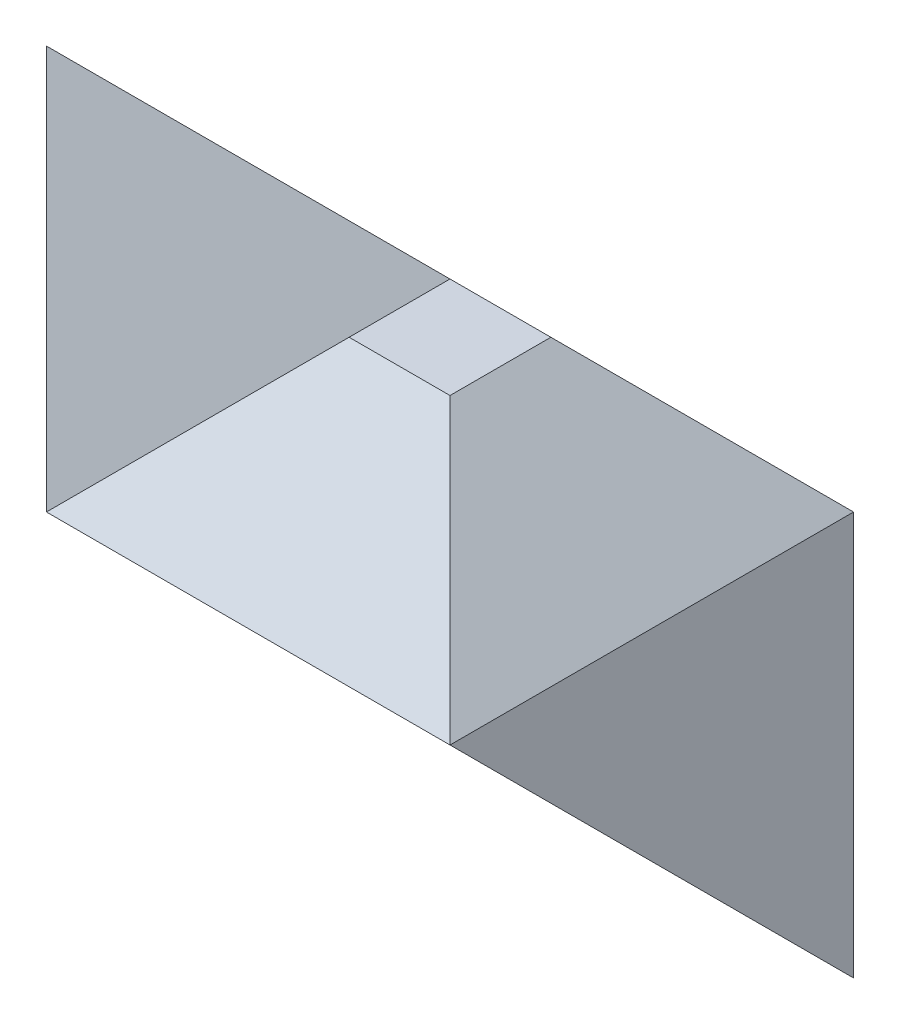
ISO-10303-21;
HEADER;
FILE_DESCRIPTION(('STEP AP214'),'2;1');
FILE_NAME('part.step','',(''),(''),'','','');
FILE_SCHEMA(('AUTOMOTIVE_DESIGN { 1 0 10303 214 1 1 1 1 }'));
ENDSEC;
DATA;
#1=APPLICATION_CONTEXT('core data for automotive mechanical design processes');
#2=APPLICATION_PROTOCOL_DEFINITION('international standard','automotive_design',2000,#1);
#3=PRODUCT_CONTEXT('',#1,'mechanical');
#4=PRODUCT('Part','Part','',(#3));
#5=PRODUCT_RELATED_PRODUCT_CATEGORY('part','',(#4));
#6=PRODUCT_DEFINITION_FORMATION('','',#4);
#7=PRODUCT_DEFINITION_CONTEXT('part definition',#1,'design');
#8=PRODUCT_DEFINITION('design','',#6,#7);
#9=PRODUCT_DEFINITION_SHAPE('','',#8);
#10=(LENGTH_UNIT() NAMED_UNIT(*) SI_UNIT(.MILLI.,.METRE.));
#11=(NAMED_UNIT(*) PLANE_ANGLE_UNIT() SI_UNIT($,.RADIAN.));
#12=(NAMED_UNIT(*) SI_UNIT($,.STERADIAN.) SOLID_ANGLE_UNIT());
#13=UNCERTAINTY_MEASURE_WITH_UNIT(LENGTH_MEASURE(1.E-05),#10,'distance_accuracy_value','');
#14=(GEOMETRIC_REPRESENTATION_CONTEXT(3) GLOBAL_UNCERTAINTY_ASSIGNED_CONTEXT((#13)) GLOBAL_UNIT_ASSIGNED_CONTEXT((#10,
#11,#12)) REPRESENTATION_CONTEXT('',''));
#15=CARTESIAN_POINT('',(0.,0.,0.));
#16=DIRECTION('',(0.,0.,1.));
#17=DIRECTION('',(1.,0.,0.));
#18=AXIS2_PLACEMENT_3D('',#15,#16,#17);
#19=CARTESIAN_POINT('',(0.,0.,0.));
#20=DIRECTION('',(0.707106781186549,0.,-0.707106781186546));
#21=DIRECTION('',(-0.707106781186546,0.,-0.707106781186549));
#22=AXIS2_PLACEMENT_3D('',#19,#20,#21);
#23=PLANE('',#22);
#24=DIRECTION('',(-0.577350269189626,0.577350269189624,-0.577350269189628));
#25=VECTOR('',#24,1.);
#26=CARTESIAN_POINT('',(0.,0.,0.));
#27=LINE('',#26,#25);
#28=CARTESIAN_POINT('',(0.,0.,0.));
#29=VERTEX_POINT('',#28);
#30=CARTESIAN_POINT('',(-12.7,12.7,-12.7000000000001));
#31=VERTEX_POINT('',#30);
#32=EDGE_CURVE('E175',#29,#31,#27,.T.);
#33=ORIENTED_EDGE('',*,*,#32,.T.);
#34=DIRECTION('',(0.,1.,0.));
#35=VECTOR('',#34,1.);
#36=CARTESIAN_POINT('',(-12.7,0.,-12.7000000000001));
#37=LINE('',#36,#35);
#38=CARTESIAN_POINT('',(-12.7,-12.7,-12.7000000000001));
#39=VERTEX_POINT('',#38);
#40=EDGE_CURVE('E97',#39,#31,#37,.T.);
#41=ORIENTED_EDGE('',*,*,#40,.F.);
#42=DIRECTION('',(-0.577350269189626,-0.577350269189624,-0.577350269189628));
#43=VECTOR('',#42,1.);
#44=CARTESIAN_POINT('',(0.,0.,0.));
#45=LINE('',#44,#43);
#46=EDGE_CURVE('E179',#29,#39,#45,.T.);
#47=ORIENTED_EDGE('',*,*,#46,.F.);
#48=EDGE_LOOP('',(#33,#41,#47));
#49=FACE_BOUND('',#48,.T.);
#50=ADVANCED_FACE('F88',(#49),#23,.F.);
#51=CARTESIAN_POINT('',(-12.7,0.,-12.7000000000001));
#52=DIRECTION('',(0.707106781186544,0.,0.707106781186551));
#53=DIRECTION('',(0.707106781186551,0.,-0.707106781186544));
#54=AXIS2_PLACEMENT_3D('',#51,#52,#53);
#55=PLANE('',#54);
#56=ORIENTED_EDGE('',*,*,#40,.T.);
#57=DIRECTION('',(-0.577350269189629,0.577350269189627,0.577350269189622));
#58=VECTOR('',#57,1.);
#59=CARTESIAN_POINT('',(0.,0.,-25.4));
#60=LINE('',#59,#58);
#61=CARTESIAN_POINT('',(0.,0.,-25.4));
#62=VERTEX_POINT('',#61);
#63=EDGE_CURVE('E12',#62,#31,#60,.T.);
#64=ORIENTED_EDGE('',*,*,#63,.F.);
#65=DIRECTION('',(-0.577350269189629,-0.577350269189627,0.577350269189622));
#66=VECTOR('',#65,1.);
#67=CARTESIAN_POINT('',(0.,0.,-25.4));
#68=LINE('',#67,#66);
#69=EDGE_CURVE('E109',#62,#39,#68,.T.);
#70=ORIENTED_EDGE('',*,*,#69,.T.);
#71=EDGE_LOOP('',(#56,#64,#70));
#72=FACE_BOUND('',#71,.T.);
#73=ADVANCED_FACE('F344',(#72),#55,.F.);
#74=CARTESIAN_POINT('',(0.,0.,0.));
#75=DIRECTION('',(-0.707106781186546,-0.707106781186549,0.));
#76=DIRECTION('',(0.707106781186549,-0.707106781186546,0.));
#77=AXIS2_PLACEMENT_3D('',#74,#75,#76);
#78=PLANE('',#77);
#79=ORIENTED_EDGE('',*,*,#63,.T.);
#80=ORIENTED_EDGE('',*,*,#32,.F.);
#81=DIRECTION('',(0.,0.,-1.));
#82=VECTOR('',#81,1.);
#83=CARTESIAN_POINT('',(0.,0.,0.));
#84=LINE('',#83,#82);
#85=EDGE_CURVE('E168',#29,#62,#84,.T.);
#86=ORIENTED_EDGE('',*,*,#85,.T.);
#87=EDGE_LOOP('',(#79,#80,#86));
#88=FACE_BOUND('',#87,.T.);
#89=ADVANCED_FACE('F90',(#88),#78,.F.);
#90=CARTESIAN_POINT('',(0.,0.,0.));
#91=DIRECTION('',(0.,-0.70710678118655,0.707106781186545));
#92=DIRECTION('',(-0.577350269189626,-0.577350269189624,-0.577350269189628));
#93=AXIS2_PLACEMENT_3D('',#90,#91,#92);
#94=PLANE('',#93);
#95=ORIENTED_EDGE('',*,*,#46,.T.);
#96=DIRECTION('',(1.,0.,0.));
#97=VECTOR('',#96,1.);
#98=CARTESIAN_POINT('',(12.7,-12.7,-12.7000000000001));
#99=LINE('',#98,#97);
#100=CARTESIAN_POINT('',(38.1000000000001,-12.7,-12.7000000000001));
#101=VERTEX_POINT('',#100);
#102=EDGE_CURVE('E183',#39,#101,#99,.T.);
#103=ORIENTED_EDGE('',*,*,#102,.T.);
#104=DIRECTION('',(0.577350269189626,-0.577350269189624,-0.577350269189628));
#105=VECTOR('',#104,1.);
#106=CARTESIAN_POINT('',(31.75,-6.35,-6.35000000000004));
#107=LINE('',#106,#105);
#108=CARTESIAN_POINT('',(25.4,0.,0.));
#109=VERTEX_POINT('',#108);
#110=EDGE_CURVE('E188',#109,#101,#107,.T.);
#111=ORIENTED_EDGE('',*,*,#110,.F.);
#112=DIRECTION('',(1.,0.,0.));
#113=VECTOR('',#112,1.);
#114=CARTESIAN_POINT('',(12.7,0.,0.));
#115=LINE('',#114,#113);
#116=EDGE_CURVE('E157',#29,#109,#115,.T.);
#117=ORIENTED_EDGE('',*,*,#116,.F.);
#118=EDGE_LOOP('',(#95,#103,#111,#117));
#119=FACE_BOUND('',#118,.T.);
#120=ADVANCED_FACE('F186',(#119),#94,.T.);
#121=CARTESIAN_POINT('',(-12.7,-12.7,-12.7000000000001));
#122=DIRECTION('',(0.,-0.707106781186545,-0.70710678118655));
#123=DIRECTION('',(0.577350269189629,0.577350269189627,-0.577350269189622));
#124=AXIS2_PLACEMENT_3D('',#121,#122,#123);
#125=PLANE('',#124);
#126=ORIENTED_EDGE('',*,*,#69,.F.);
#127=DIRECTION('',(1.,0.,0.));
#128=VECTOR('',#127,1.);
#129=CARTESIAN_POINT('',(12.7,0.,-25.4));
#130=LINE('',#129,#128);
#131=CARTESIAN_POINT('',(25.4,0.,-25.4));
#132=VERTEX_POINT('',#131);
#133=EDGE_CURVE('E189',#62,#132,#130,.T.);
#134=ORIENTED_EDGE('',*,*,#133,.T.);
#135=DIRECTION('',(-0.577350269189629,0.577350269189626,-0.577350269189622));
#136=VECTOR('',#135,1.);
#137=CARTESIAN_POINT('',(31.75,-6.35,-19.05));
#138=LINE('',#137,#136);
#139=EDGE_CURVE('E192',#101,#132,#138,.T.);
#140=ORIENTED_EDGE('',*,*,#139,.F.);
#141=ORIENTED_EDGE('',*,*,#102,.F.);
#142=EDGE_LOOP('',(#126,#134,#140,#141));
#143=FACE_BOUND('',#142,.T.);
#144=ADVANCED_FACE('F350',(#143),#125,.T.);
#145=CARTESIAN_POINT('',(12.7,0.,12.7));
#146=DIRECTION('',(0.707106781186549,0.,0.707106781186546));
#147=DIRECTION('',(0.707106781186546,0.,-0.707106781186549));
#148=AXIS2_PLACEMENT_3D('',#145,#146,#147);
#149=PLANE('',#148);
#150=DIRECTION('',(0.,1.,0.));
#151=VECTOR('',#150,1.);
#152=CARTESIAN_POINT('',(38.1000000000001,0.,-12.7000000000001));
#153=LINE('',#152,#151);
#154=CARTESIAN_POINT('',(38.1000000000001,12.7,-12.7000000000001));
#155=VERTEX_POINT('',#154);
#156=EDGE_CURVE('E230',#101,#155,#153,.T.);
#157=ORIENTED_EDGE('',*,*,#156,.T.);
#158=DIRECTION('',(0.577350269189626,0.577350269189624,-0.577350269189628));
#159=VECTOR('',#158,1.);
#160=CARTESIAN_POINT('',(25.4,0.,0.));
#161=LINE('',#160,#159);
#162=EDGE_CURVE('E129',#109,#155,#161,.T.);
#163=ORIENTED_EDGE('',*,*,#162,.F.);
#164=ORIENTED_EDGE('',*,*,#110,.T.);
#165=EDGE_LOOP('',(#157,#163,#164));
#166=FACE_BOUND('',#165,.T.);
#167=ADVANCED_FACE('F255',(#166),#149,.T.);
#168=CARTESIAN_POINT('',(12.6999999999999,-12.7,0.));
#169=DIRECTION('',(0.707106781186546,-0.707106781186549,0.));
#170=DIRECTION('',(0.707106781186549,0.707106781186546,0.));
#171=AXIS2_PLACEMENT_3D('',#168,#169,#170);
#172=PLANE('',#171);
#173=ORIENTED_EDGE('',*,*,#162,.T.);
#174=DIRECTION('',(0.577350269189629,0.577350269189626,0.577350269189622));
#175=VECTOR('',#174,1.);
#176=CARTESIAN_POINT('',(25.4,0.,-25.4));
#177=LINE('',#176,#175);
#178=EDGE_CURVE('E203',#132,#155,#177,.T.);
#179=ORIENTED_EDGE('',*,*,#178,.F.);
#180=DIRECTION('',(0.,0.,1.));
#181=VECTOR('',#180,1.);
#182=CARTESIAN_POINT('',(25.4,0.,-12.7));
#183=LINE('',#182,#181);
#184=EDGE_CURVE('E201',#132,#109,#183,.T.);
#185=ORIENTED_EDGE('',*,*,#184,.T.);
#186=EDGE_LOOP('',(#173,#179,#185));
#187=FACE_BOUND('',#186,.T.);
#188=ADVANCED_FACE('F357',(#187),#172,.F.);
#189=CARTESIAN_POINT('',(25.3999999999999,0.,-25.4000000000001));
#190=DIRECTION('',(-0.707106781186544,0.,0.707106781186551));
#191=DIRECTION('',(0.707106781186551,0.,0.707106781186544));
#192=AXIS2_PLACEMENT_3D('',#189,#190,#191);
#193=PLANE('',#192);
#194=ORIENTED_EDGE('',*,*,#178,.T.);
#195=ORIENTED_EDGE('',*,*,#156,.F.);
#196=ORIENTED_EDGE('',*,*,#139,.T.);
#197=EDGE_LOOP('',(#194,#195,#196));
#198=FACE_BOUND('',#197,.T.);
#199=ADVANCED_FACE('F251',(#198),#193,.F.);
#200=CARTESIAN_POINT('',(0.,9.525,0.));
#201=DIRECTION('',(0.,1.,0.));
#202=DIRECTION('',(0.,0.,1.));
#203=AXIS2_PLACEMENT_3D('',#200,#201,#202);
#204=PLANE('',#203);
#205=DIRECTION('',(0.,0.,1.));
#206=VECTOR('',#205,1.);
#207=CARTESIAN_POINT('',(9.525,9.525,-15.875));
#208=LINE('',#207,#206);
#209=CARTESIAN_POINT('',(9.525,9.525,-15.875));
#210=VERTEX_POINT('',#209);
#211=CARTESIAN_POINT('',(9.525,9.525,-9.525));
#212=VERTEX_POINT('',#211);
#213=EDGE_CURVE('E281',#210,#212,#208,.T.);
#214=ORIENTED_EDGE('',*,*,#213,.T.);
#215=DIRECTION('',(1.,0.,0.));
#216=VECTOR('',#215,1.);
#217=CARTESIAN_POINT('',(9.525,9.525,-9.525));
#218=LINE('',#217,#216);
#219=CARTESIAN_POINT('',(15.875,9.525,-9.525));
#220=VERTEX_POINT('',#219);
#221=EDGE_CURVE('E160',#212,#220,#218,.T.);
#222=ORIENTED_EDGE('',*,*,#221,.T.);
#223=DIRECTION('',(0.,0.,-1.));
#224=VECTOR('',#223,1.);
#225=CARTESIAN_POINT('',(15.875,9.525,-15.875));
#226=LINE('',#225,#224);
#227=CARTESIAN_POINT('',(15.875,9.525,-15.875));
#228=VERTEX_POINT('',#227);
#229=EDGE_CURVE('E280',#220,#228,#226,.T.);
#230=ORIENTED_EDGE('',*,*,#229,.T.);
#231=DIRECTION('',(-1.,0.,0.));
#232=VECTOR('',#231,1.);
#233=CARTESIAN_POINT('',(9.525,9.525,-15.875));
#234=LINE('',#233,#232);
#235=EDGE_CURVE('E234',#228,#210,#234,.T.);
#236=ORIENTED_EDGE('',*,*,#235,.T.);
#237=EDGE_LOOP('',(#214,#222,#230,#236));
#238=FACE_BOUND('',#237,.T.);
#239=ADVANCED_FACE('F240',(#238),#204,.T.);
#240=CARTESIAN_POINT('',(0.,12.7,-12.7));
#241=DIRECTION('',(0.,-0.707106781186547,0.707106781186548));
#242=DIRECTION('',(0.,-0.707106781186548,-0.707106781186547));
#243=AXIS2_PLACEMENT_3D('',#240,#241,#242);
#244=PLANE('',#243);
#245=DIRECTION('',(0.577350269189626,0.577350269189626,0.577350269189625));
#246=VECTOR('',#245,1.);
#247=CARTESIAN_POINT('',(0.,0.,-25.4));
#248=LINE('',#247,#246);
#249=EDGE_CURVE('E172',#62,#210,#248,.T.);
#250=ORIENTED_EDGE('',*,*,#249,.T.);
#251=ORIENTED_EDGE('',*,*,#235,.F.);
#252=DIRECTION('',(-0.577350269189626,0.577350269189626,0.577350269189626));
#253=VECTOR('',#252,1.);
#254=CARTESIAN_POINT('',(25.4,0.,-25.4));
#255=LINE('',#254,#253);
#256=EDGE_CURVE('E134',#132,#228,#255,.T.);
#257=ORIENTED_EDGE('',*,*,#256,.F.);
#258=ORIENTED_EDGE('',*,*,#133,.F.);
#259=EDGE_LOOP('',(#250,#251,#257,#258));
#260=FACE_BOUND('',#259,.T.);
#261=ADVANCED_FACE('F250',(#260),#244,.F.);
#262=CARTESIAN_POINT('',(12.7,12.7,0.));
#263=DIRECTION('',(-0.707106781186548,-0.707106781186547,0.));
#264=DIRECTION('',(0.707106781186547,-0.707106781186548,0.));
#265=AXIS2_PLACEMENT_3D('',#262,#263,#264);
#266=PLANE('',#265);
#267=ORIENTED_EDGE('',*,*,#256,.T.);
#268=ORIENTED_EDGE('',*,*,#229,.F.);
#269=DIRECTION('',(-0.577350269189626,0.577350269189626,-0.577350269189626));
#270=VECTOR('',#269,1.);
#271=CARTESIAN_POINT('',(25.4,0.,0.));
#272=LINE('',#271,#270);
#273=EDGE_CURVE('E121',#109,#220,#272,.T.);
#274=ORIENTED_EDGE('',*,*,#273,.F.);
#275=ORIENTED_EDGE('',*,*,#184,.F.);
#276=EDGE_LOOP('',(#267,#268,#274,#275));
#277=FACE_BOUND('',#276,.T.);
#278=ADVANCED_FACE('F296',(#277),#266,.F.);
#279=CARTESIAN_POINT('',(0.,0.,0.));
#280=DIRECTION('',(0.707106781186547,-0.707106781186548,0.));
#281=DIRECTION('',(0.707106781186548,0.707106781186547,0.));
#282=AXIS2_PLACEMENT_3D('',#279,#280,#281);
#283=PLANE('',#282);
#284=DIRECTION('',(0.577350269189626,0.577350269189626,-0.577350269189626));
#285=VECTOR('',#284,1.);
#286=CARTESIAN_POINT('',(0.,0.,0.));
#287=LINE('',#286,#285);
#288=EDGE_CURVE('E153',#29,#212,#287,.T.);
#289=ORIENTED_EDGE('',*,*,#288,.T.);
#290=ORIENTED_EDGE('',*,*,#213,.F.);
#291=ORIENTED_EDGE('',*,*,#249,.F.);
#292=ORIENTED_EDGE('',*,*,#85,.F.);
#293=EDGE_LOOP('',(#289,#290,#291,#292));
#294=FACE_BOUND('',#293,.T.);
#295=ADVANCED_FACE('F170',(#294),#283,.F.);
#296=CARTESIAN_POINT('',(0.,0.,0.));
#297=DIRECTION('',(0.,-0.707106781186547,-0.707106781186548));
#298=DIRECTION('',(0.,0.707106781186548,-0.707106781186547));
#299=AXIS2_PLACEMENT_3D('',#296,#297,#298);
#300=PLANE('',#299);
#301=ORIENTED_EDGE('',*,*,#273,.T.);
#302=ORIENTED_EDGE('',*,*,#221,.F.);
#303=ORIENTED_EDGE('',*,*,#288,.F.);
#304=ORIENTED_EDGE('',*,*,#116,.T.);
#305=EDGE_LOOP('',(#301,#302,#303,#304));
#306=FACE_BOUND('',#305,.T.);
#307=ADVANCED_FACE('F155',(#306),#300,.F.);
#308=CLOSED_SHELL('',(#50,#73,#89,#120,#144,#167,#188,#199,#239,#261,#278,#295,#307));
#309=MANIFOLD_SOLID_BREP('B2',#308);
#310=ADVANCED_BREP_SHAPE_REPRESENTATION('',(#18,#309),#14);
#311=SHAPE_DEFINITION_REPRESENTATION(#9,#310);
ENDSEC;
END-ISO-10303-21;
